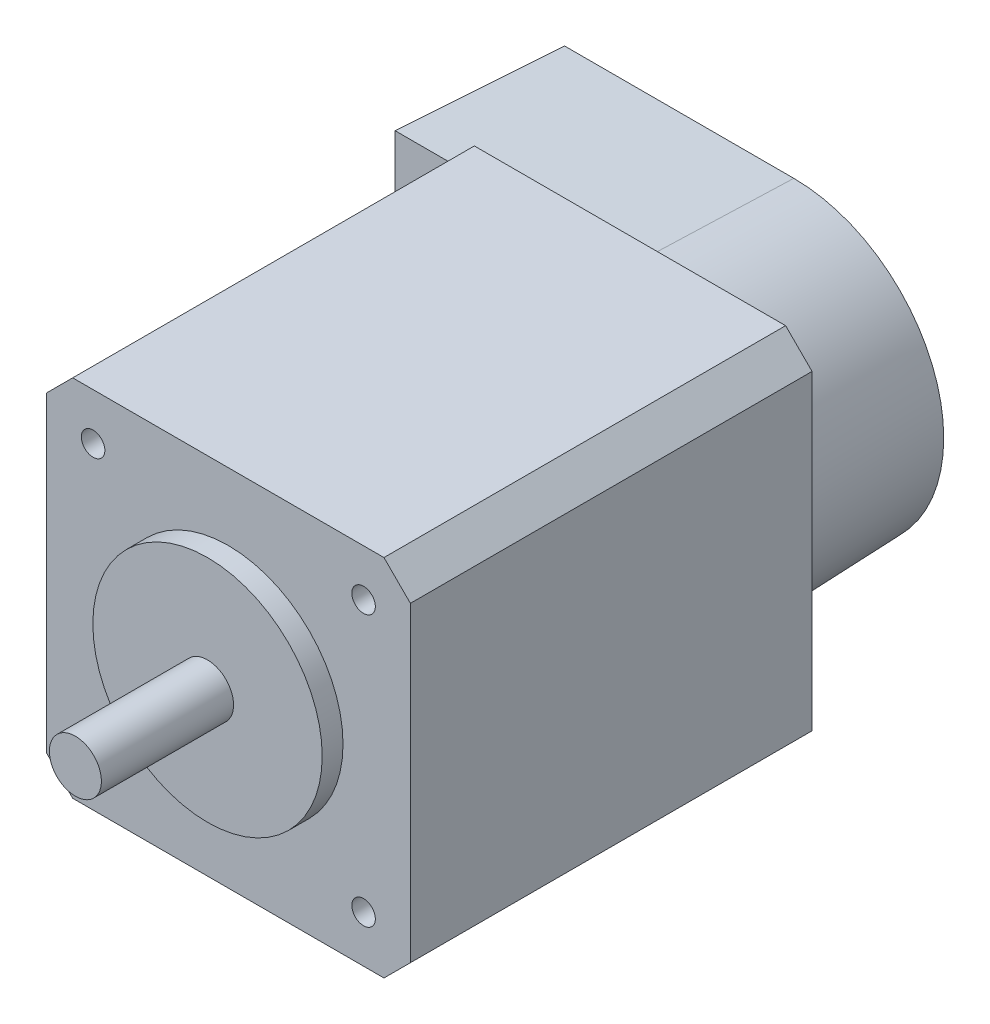
ISO-10303-21;
HEADER;
FILE_DESCRIPTION(('STEP AP214'),'2;1');
FILE_NAME('part.step','',(''),(''),'','','');
FILE_SCHEMA(('AUTOMOTIVE_DESIGN { 1 0 10303 214 1 1 1 1 }'));
ENDSEC;
DATA;
#1=APPLICATION_CONTEXT('core data for automotive mechanical design processes');
#2=APPLICATION_PROTOCOL_DEFINITION('international standard','automotive_design',2000,#1);
#3=PRODUCT_CONTEXT('',#1,'mechanical');
#4=PRODUCT('Part','Part','',(#3));
#5=PRODUCT_RELATED_PRODUCT_CATEGORY('part','',(#4));
#6=PRODUCT_DEFINITION_FORMATION('','',#4);
#7=PRODUCT_DEFINITION_CONTEXT('part definition',#1,'design');
#8=PRODUCT_DEFINITION('design','',#6,#7);
#9=PRODUCT_DEFINITION_SHAPE('','',#8);
#10=(LENGTH_UNIT() NAMED_UNIT(*) SI_UNIT(.MILLI.,.METRE.));
#11=(NAMED_UNIT(*) PLANE_ANGLE_UNIT() SI_UNIT($,.RADIAN.));
#12=(NAMED_UNIT(*) SI_UNIT($,.STERADIAN.) SOLID_ANGLE_UNIT());
#13=UNCERTAINTY_MEASURE_WITH_UNIT(LENGTH_MEASURE(1.E-05),#10,'distance_accuracy_value','');
#14=(GEOMETRIC_REPRESENTATION_CONTEXT(3) GLOBAL_UNCERTAINTY_ASSIGNED_CONTEXT((#13)) GLOBAL_UNIT_ASSIGNED_CONTEXT((#10,
#11,#12)) REPRESENTATION_CONTEXT('',''));
#15=CARTESIAN_POINT('',(0.,0.,0.));
#16=DIRECTION('',(0.,0.,1.));
#17=DIRECTION('',(1.,0.,0.));
#18=AXIS2_PLACEMENT_3D('',#15,#16,#17);
#19=CARTESIAN_POINT('',(0.,0.,38.608));
#20=DIRECTION('',(0.,0.,-1.));
#21=DIRECTION('',(-1.,0.,0.));
#22=AXIS2_PLACEMENT_3D('',#19,#20,#21);
#23=PLANE('',#22);
#24=CARTESIAN_POINT('',(4.49999999999995,30.5,38.608));
#25=DIRECTION('',(0.,0.,1.));
#26=DIRECTION('',(1.,0.,0.));
#27=AXIS2_PLACEMENT_3D('',#24,#25,#26);
#28=CIRCLE('',#27,1.1303);
#29=CARTESIAN_POINT('',(5.63029999999995,30.5,38.608));
#30=VERTEX_POINT('',#29);
#31=EDGE_CURVE('E148',#30,#30,#28,.T.);
#32=ORIENTED_EDGE('',*,*,#31,.F.);
#33=EDGE_LOOP('',(#32));
#34=FACE_BOUND('',#33,.T.);
#35=CARTESIAN_POINT('',(17.5,17.5,38.608));
#36=DIRECTION('',(0.,0.,-1.));
#37=DIRECTION('',(-1.,0.,0.));
#38=AXIS2_PLACEMENT_3D('',#35,#36,#37);
#39=CIRCLE('',#38,11.0236);
#40=CARTESIAN_POINT('',(6.47639999999998,17.5,38.608));
#41=VERTEX_POINT('',#40);
#42=EDGE_CURVE('E41',#41,#41,#39,.F.);
#43=ORIENTED_EDGE('',*,*,#42,.F.);
#44=EDGE_LOOP('',(#43));
#45=FACE_BOUND('',#44,.T.);
#46=DIRECTION('',(0.,-1.,0.));
#47=VECTOR('',#46,1.);
#48=CARTESIAN_POINT('',(0.,0.,38.608));
#49=LINE('',#48,#47);
#50=CARTESIAN_POINT('',(0.,32.46,38.608));
#51=VERTEX_POINT('',#50);
#52=CARTESIAN_POINT('',(0.,2.54000000000002,38.608));
#53=VERTEX_POINT('',#52);
#54=EDGE_CURVE('E205',#51,#53,#49,.T.);
#55=ORIENTED_EDGE('',*,*,#54,.T.);
#56=DIRECTION('',(-0.707106781186546,0.70710678118655,0.));
#57=VECTOR('',#56,1.);
#58=CARTESIAN_POINT('',(2.54,0.,38.608));
#59=LINE('',#58,#57);
#60=CARTESIAN_POINT('',(2.54,0.,38.608));
#61=VERTEX_POINT('',#60);
#62=EDGE_CURVE('E249',#53,#61,#59,.F.);
#63=ORIENTED_EDGE('',*,*,#62,.T.);
#64=DIRECTION('',(1.,0.,0.));
#65=VECTOR('',#64,1.);
#66=CARTESIAN_POINT('',(0.,0.,38.608));
#67=LINE('',#66,#65);
#68=CARTESIAN_POINT('',(32.46,0.,38.608));
#69=VERTEX_POINT('',#68);
#70=EDGE_CURVE('E208',#61,#69,#67,.T.);
#71=ORIENTED_EDGE('',*,*,#70,.T.);
#72=DIRECTION('',(-0.70710678118655,-0.707106781186546,0.));
#73=VECTOR('',#72,1.);
#74=CARTESIAN_POINT('',(35.,2.54,38.608));
#75=LINE('',#74,#73);
#76=CARTESIAN_POINT('',(35.,2.54,38.608));
#77=VERTEX_POINT('',#76);
#78=EDGE_CURVE('E247',#69,#77,#75,.F.);
#79=ORIENTED_EDGE('',*,*,#78,.T.);
#80=DIRECTION('',(0.,1.,0.));
#81=VECTOR('',#80,1.);
#82=CARTESIAN_POINT('',(35.,0.,38.608));
#83=LINE('',#82,#81);
#84=CARTESIAN_POINT('',(35.,32.46,38.608));
#85=VERTEX_POINT('',#84);
#86=EDGE_CURVE('E212',#77,#85,#83,.T.);
#87=ORIENTED_EDGE('',*,*,#86,.T.);
#88=DIRECTION('',(0.707106781186547,-0.707106781186549,0.));
#89=VECTOR('',#88,1.);
#90=CARTESIAN_POINT('',(32.46,35.,38.608));
#91=LINE('',#90,#89);
#92=CARTESIAN_POINT('',(32.46,35.,38.608));
#93=VERTEX_POINT('',#92);
#94=EDGE_CURVE('E243',#85,#93,#91,.F.);
#95=ORIENTED_EDGE('',*,*,#94,.T.);
#96=DIRECTION('',(-1.,0.,0.));
#97=VECTOR('',#96,1.);
#98=CARTESIAN_POINT('',(0.,35.,38.608));
#99=LINE('',#98,#97);
#100=CARTESIAN_POINT('',(2.54000000000002,35.,38.608));
#101=VERTEX_POINT('',#100);
#102=EDGE_CURVE('E215',#93,#101,#99,.T.);
#103=ORIENTED_EDGE('',*,*,#102,.T.);
#104=DIRECTION('',(0.707106781186549,0.707106781186547,0.));
#105=VECTOR('',#104,1.);
#106=CARTESIAN_POINT('',(0.,32.46,38.608));
#107=LINE('',#106,#105);
#108=EDGE_CURVE('E245',#101,#51,#107,.F.);
#109=ORIENTED_EDGE('',*,*,#108,.T.);
#110=EDGE_LOOP('',(#55,#63,#71,#79,#87,#95,#103,#109));
#111=FACE_BOUND('',#110,.T.);
#112=CARTESIAN_POINT('',(30.5,30.5,38.608));
#113=DIRECTION('',(0.,0.,1.));
#114=DIRECTION('',(1.,0.,0.));
#115=AXIS2_PLACEMENT_3D('',#112,#113,#114);
#116=CIRCLE('',#115,1.1303);
#117=CARTESIAN_POINT('',(31.6303,30.5,38.608));
#118=VERTEX_POINT('',#117);
#119=EDGE_CURVE('E190',#118,#118,#116,.T.);
#120=ORIENTED_EDGE('',*,*,#119,.F.);
#121=EDGE_LOOP('',(#120));
#122=FACE_BOUND('',#121,.T.);
#123=CARTESIAN_POINT('',(4.49999999999995,4.50000000000002,38.608));
#124=DIRECTION('',(0.,0.,1.));
#125=DIRECTION('',(1.,0.,0.));
#126=AXIS2_PLACEMENT_3D('',#123,#124,#125);
#127=CIRCLE('',#126,1.1303);
#128=CARTESIAN_POINT('',(5.63029999999995,4.50000000000002,38.608));
#129=VERTEX_POINT('',#128);
#130=EDGE_CURVE('E184',#129,#129,#127,.T.);
#131=ORIENTED_EDGE('',*,*,#130,.F.);
#132=EDGE_LOOP('',(#131));
#133=FACE_BOUND('',#132,.T.);
#134=CARTESIAN_POINT('',(30.5,4.50000000000002,38.608));
#135=DIRECTION('',(0.,0.,1.));
#136=DIRECTION('',(1.,0.,0.));
#137=AXIS2_PLACEMENT_3D('',#134,#135,#136);
#138=CIRCLE('',#137,1.1303);
#139=CARTESIAN_POINT('',(31.6303,4.50000000000002,38.608));
#140=VERTEX_POINT('',#139);
#141=EDGE_CURVE('E178',#140,#140,#138,.T.);
#142=ORIENTED_EDGE('',*,*,#141,.F.);
#143=EDGE_LOOP('',(#142));
#144=FACE_BOUND('',#143,.T.);
#145=ADVANCED_FACE('F37',(#34,#45,#111,#122,#133,#144),#23,.F.);
#146=CARTESIAN_POINT('',(17.5,17.5,40.608));
#147=DIRECTION('',(0.,0.,1.));
#148=DIRECTION('',(1.,0.,0.));
#149=AXIS2_PLACEMENT_3D('',#146,#147,#148);
#150=PLANE('',#149);
#151=CARTESIAN_POINT('',(17.5,17.5,40.608));
#152=DIRECTION('',(0.,0.,1.));
#153=DIRECTION('',(1.,0.,0.));
#154=AXIS2_PLACEMENT_3D('',#151,#152,#153);
#155=CIRCLE('',#154,11.0236);
#156=CARTESIAN_POINT('',(28.5236,17.5,40.608));
#157=VERTEX_POINT('',#156);
#158=EDGE_CURVE('E200',#157,#157,#155,.T.);
#159=ORIENTED_EDGE('',*,*,#158,.T.);
#160=EDGE_LOOP('',(#159));
#161=FACE_BOUND('',#160,.T.);
#162=CARTESIAN_POINT('',(17.5,17.5,40.608));
#163=DIRECTION('',(0.,0.,1.));
#164=DIRECTION('',(1.,0.,0.));
#165=AXIS2_PLACEMENT_3D('',#162,#163,#164);
#166=CIRCLE('',#165,2.5);
#167=CARTESIAN_POINT('',(20.,17.5,40.608));
#168=VERTEX_POINT('',#167);
#169=EDGE_CURVE('E196',#168,#168,#166,.T.);
#170=ORIENTED_EDGE('',*,*,#169,.F.);
#171=EDGE_LOOP('',(#170));
#172=FACE_BOUND('',#171,.T.);
#173=ADVANCED_FACE('F265',(#161,#172),#150,.T.);
#174=CARTESIAN_POINT('',(0.,0.,38.608));
#175=DIRECTION('',(1.,0.,0.));
#176=DIRECTION('',(0.,0.,-1.));
#177=AXIS2_PLACEMENT_3D('',#174,#175,#176);
#178=PLANE('',#177);
#179=DIRECTION('',(0.,-1.,0.));
#180=VECTOR('',#179,1.);
#181=CARTESIAN_POINT('',(0.,0.,0.));
#182=LINE('',#181,#180);
#183=CARTESIAN_POINT('',(0.,32.46,0.));
#184=VERTEX_POINT('',#183);
#185=CARTESIAN_POINT('',(0.,2.54000000000001,0.));
#186=VERTEX_POINT('',#185);
#187=EDGE_CURVE('E137',#184,#186,#182,.T.);
#188=ORIENTED_EDGE('',*,*,#187,.T.);
#189=DIRECTION('',(0.,0.,1.));
#190=VECTOR('',#189,1.);
#191=CARTESIAN_POINT('',(0.,2.54000000000001,38.608));
#192=LINE('',#191,#190);
#193=EDGE_CURVE('E241',#186,#53,#192,.T.);
#194=ORIENTED_EDGE('',*,*,#193,.T.);
#195=ORIENTED_EDGE('',*,*,#54,.F.);
#196=DIRECTION('',(0.,0.,-1.));
#197=VECTOR('',#196,1.);
#198=CARTESIAN_POINT('',(0.,32.46,38.608));
#199=LINE('',#198,#197);
#200=EDGE_CURVE('E238',#51,#184,#199,.T.);
#201=ORIENTED_EDGE('',*,*,#200,.T.);
#202=EDGE_LOOP('',(#188,#194,#195,#201));
#203=FACE_BOUND('',#202,.T.);
#204=ADVANCED_FACE('F309',(#203),#178,.F.);
#205=CARTESIAN_POINT('',(0.,0.,38.608));
#206=DIRECTION('',(0.,1.,0.));
#207=DIRECTION('',(0.,0.,1.));
#208=AXIS2_PLACEMENT_3D('',#205,#206,#207);
#209=PLANE('',#208);
#210=ORIENTED_EDGE('',*,*,#70,.F.);
#211=DIRECTION('',(0.,0.,-1.));
#212=VECTOR('',#211,1.);
#213=CARTESIAN_POINT('',(2.54,0.,38.608));
#214=LINE('',#213,#212);
#215=CARTESIAN_POINT('',(2.54,0.,0.));
#216=VERTEX_POINT('',#215);
#217=EDGE_CURVE('E227',#61,#216,#214,.T.);
#218=ORIENTED_EDGE('',*,*,#217,.T.);
#219=DIRECTION('',(1.,0.,0.));
#220=VECTOR('',#219,1.);
#221=CARTESIAN_POINT('',(0.,0.,0.));
#222=LINE('',#221,#220);
#223=CARTESIAN_POINT('',(32.46,0.,0.));
#224=VERTEX_POINT('',#223);
#225=EDGE_CURVE('E219',#216,#224,#222,.T.);
#226=ORIENTED_EDGE('',*,*,#225,.T.);
#227=DIRECTION('',(0.,0.,1.));
#228=VECTOR('',#227,1.);
#229=CARTESIAN_POINT('',(32.46,0.,38.608));
#230=LINE('',#229,#228);
#231=EDGE_CURVE('E217',#224,#69,#230,.T.);
#232=ORIENTED_EDGE('',*,*,#231,.T.);
#233=EDGE_LOOP('',(#210,#218,#226,#232));
#234=FACE_BOUND('',#233,.T.);
#235=ADVANCED_FACE('F324',(#234),#209,.F.);
#236=CARTESIAN_POINT('',(35.,0.,38.608));
#237=DIRECTION('',(-1.,0.,0.));
#238=DIRECTION('',(0.,0.,1.));
#239=AXIS2_PLACEMENT_3D('',#236,#237,#238);
#240=PLANE('',#239);
#241=ORIENTED_EDGE('',*,*,#86,.F.);
#242=DIRECTION('',(0.,0.,-1.));
#243=VECTOR('',#242,1.);
#244=CARTESIAN_POINT('',(35.,2.54,38.608));
#245=LINE('',#244,#243);
#246=CARTESIAN_POINT('',(35.,2.54,0.));
#247=VERTEX_POINT('',#246);
#248=EDGE_CURVE('E253',#77,#247,#245,.T.);
#249=ORIENTED_EDGE('',*,*,#248,.T.);
#250=DIRECTION('',(0.,1.,0.));
#251=VECTOR('',#250,1.);
#252=CARTESIAN_POINT('',(35.,0.,0.));
#253=LINE('',#252,#251);
#254=CARTESIAN_POINT('',(35.,32.46,0.));
#255=VERTEX_POINT('',#254);
#256=EDGE_CURVE('E222',#247,#255,#253,.T.);
#257=ORIENTED_EDGE('',*,*,#256,.T.);
#258=DIRECTION('',(0.,0.,1.));
#259=VECTOR('',#258,1.);
#260=CARTESIAN_POINT('',(35.,32.46,38.608));
#261=LINE('',#260,#259);
#262=EDGE_CURVE('E251',#255,#85,#261,.T.);
#263=ORIENTED_EDGE('',*,*,#262,.T.);
#264=EDGE_LOOP('',(#241,#249,#257,#263));
#265=FACE_BOUND('',#264,.T.);
#266=ADVANCED_FACE('F321',(#265),#240,.F.);
#267=CARTESIAN_POINT('',(0.,35.,38.608));
#268=DIRECTION('',(0.,-1.,0.));
#269=DIRECTION('',(0.,0.,-1.));
#270=AXIS2_PLACEMENT_3D('',#267,#268,#269);
#271=PLANE('',#270);
#272=DIRECTION('',(-1.,0.,0.));
#273=VECTOR('',#272,1.);
#274=CARTESIAN_POINT('',(0.,35.,0.));
#275=LINE('',#274,#273);
#276=CARTESIAN_POINT('',(32.46,35.,0.));
#277=VERTEX_POINT('',#276);
#278=CARTESIAN_POINT('',(2.54000000000001,35.,0.));
#279=VERTEX_POINT('',#278);
#280=EDGE_CURVE('E209',#277,#279,#275,.T.);
#281=ORIENTED_EDGE('',*,*,#280,.T.);
#282=DIRECTION('',(0.,0.,1.));
#283=VECTOR('',#282,1.);
#284=CARTESIAN_POINT('',(2.54000000000001,35.,38.608));
#285=LINE('',#284,#283);
#286=EDGE_CURVE('E62',#279,#101,#285,.T.);
#287=ORIENTED_EDGE('',*,*,#286,.T.);
#288=ORIENTED_EDGE('',*,*,#102,.F.);
#289=DIRECTION('',(0.,0.,-1.));
#290=VECTOR('',#289,1.);
#291=CARTESIAN_POINT('',(32.46,35.,38.608));
#292=LINE('',#291,#290);
#293=EDGE_CURVE('E256',#93,#277,#292,.T.);
#294=ORIENTED_EDGE('',*,*,#293,.T.);
#295=EDGE_LOOP('',(#281,#287,#288,#294));
#296=FACE_BOUND('',#295,.T.);
#297=ADVANCED_FACE('F318',(#296),#271,.F.);
#298=CARTESIAN_POINT('',(0.,0.,0.));
#299=DIRECTION('',(0.,0.,-1.));
#300=DIRECTION('',(-1.,0.,0.));
#301=AXIS2_PLACEMENT_3D('',#298,#299,#300);
#302=PLANE('',#301);
#303=DIRECTION('',(-1.,0.,0.));
#304=VECTOR('',#303,1.);
#305=CARTESIAN_POINT('',(-5.08000000000001,2.54,0.));
#306=LINE('',#305,#304);
#307=CARTESIAN_POINT('',(17.5,2.54,0.));
#308=VERTEX_POINT('',#307);
#309=EDGE_CURVE('E54',#308,#186,#306,.T.);
#310=ORIENTED_EDGE('',*,*,#309,.F.);
#311=CARTESIAN_POINT('',(17.5,17.5,0.));
#312=DIRECTION('',(0.,0.,-1.));
#313=DIRECTION('',(1.,0.,0.));
#314=AXIS2_PLACEMENT_3D('',#311,#312,#313);
#315=CIRCLE('',#314,14.96);
#316=CARTESIAN_POINT('',(17.5,32.46,0.));
#317=VERTEX_POINT('',#316);
#318=EDGE_CURVE('E139',#317,#308,#315,.T.);
#319=ORIENTED_EDGE('',*,*,#318,.F.);
#320=DIRECTION('',(1.,0.,0.));
#321=VECTOR('',#320,1.);
#322=CARTESIAN_POINT('',(17.5,32.46,0.));
#323=LINE('',#322,#321);
#324=EDGE_CURVE('E11',#184,#317,#323,.T.);
#325=ORIENTED_EDGE('',*,*,#324,.F.);
#326=DIRECTION('',(-0.707106781186549,-0.707106781186547,0.));
#327=VECTOR('',#326,1.);
#328=CARTESIAN_POINT('',(-16.23,16.23,0.));
#329=LINE('',#328,#327);
#330=EDGE_CURVE('E232',#184,#279,#329,.F.);
#331=ORIENTED_EDGE('',*,*,#330,.T.);
#332=ORIENTED_EDGE('',*,*,#280,.F.);
#333=DIRECTION('',(-0.707106781186547,0.707106781186549,0.));
#334=VECTOR('',#333,1.);
#335=CARTESIAN_POINT('',(33.7300000000001,33.73,0.));
#336=LINE('',#335,#334);
#337=EDGE_CURVE('E230',#277,#255,#336,.F.);
#338=ORIENTED_EDGE('',*,*,#337,.T.);
#339=ORIENTED_EDGE('',*,*,#256,.F.);
#340=DIRECTION('',(0.70710678118655,0.707106781186546,0.));
#341=VECTOR('',#340,1.);
#342=CARTESIAN_POINT('',(16.2299999999999,-16.23,0.));
#343=LINE('',#342,#341);
#344=EDGE_CURVE('E234',#247,#224,#343,.F.);
#345=ORIENTED_EDGE('',*,*,#344,.T.);
#346=ORIENTED_EDGE('',*,*,#225,.F.);
#347=DIRECTION('',(0.707106781186546,-0.70710678118655,0.));
#348=VECTOR('',#347,1.);
#349=CARTESIAN_POINT('',(1.27000000000001,1.27,0.));
#350=LINE('',#349,#348);
#351=EDGE_CURVE('E236',#216,#186,#350,.F.);
#352=ORIENTED_EDGE('',*,*,#351,.T.);
#353=EDGE_LOOP('',(#310,#319,#325,#331,#332,#338,#339,#345,#346,#352));
#354=FACE_BOUND('',#353,.T.);
#355=CARTESIAN_POINT('',(30.5,4.50000000000002,0.));
#356=DIRECTION('',(0.,0.,1.));
#357=DIRECTION('',(1.,0.,0.));
#358=AXIS2_PLACEMENT_3D('',#355,#356,#357);
#359=CIRCLE('',#358,1.13029999999999);
#360=CARTESIAN_POINT('',(31.6303,4.50000000000002,0.));
#361=VERTEX_POINT('',#360);
#362=EDGE_CURVE('E181',#361,#361,#359,.T.);
#363=ORIENTED_EDGE('',*,*,#362,.T.);
#364=EDGE_LOOP('',(#363));
#365=FACE_BOUND('',#364,.T.);
#366=CARTESIAN_POINT('',(30.5,30.5,0.));
#367=DIRECTION('',(0.,0.,1.));
#368=DIRECTION('',(1.,0.,0.));
#369=AXIS2_PLACEMENT_3D('',#366,#367,#368);
#370=CIRCLE('',#369,1.13029999999999);
#371=CARTESIAN_POINT('',(31.6303,30.5,0.));
#372=VERTEX_POINT('',#371);
#373=EDGE_CURVE('E193',#372,#372,#370,.T.);
#374=ORIENTED_EDGE('',*,*,#373,.T.);
#375=EDGE_LOOP('',(#374));
#376=FACE_BOUND('',#375,.T.);
#377=ADVANCED_FACE('F314',(#354,#365,#376),#302,.T.);
#378=CARTESIAN_POINT('',(2.54,0.,38.608));
#379=DIRECTION('',(0.70710678118655,0.707106781186546,0.));
#380=DIRECTION('',(0.,0.,-1.));
#381=AXIS2_PLACEMENT_3D('',#378,#379,#380);
#382=PLANE('',#381);
#383=ORIENTED_EDGE('',*,*,#62,.F.);
#384=ORIENTED_EDGE('',*,*,#193,.F.);
#385=ORIENTED_EDGE('',*,*,#351,.F.);
#386=ORIENTED_EDGE('',*,*,#217,.F.);
#387=EDGE_LOOP('',(#383,#384,#385,#386));
#388=FACE_BOUND('',#387,.T.);
#389=ADVANCED_FACE('F317',(#388),#382,.F.);
#390=CARTESIAN_POINT('',(35.,2.54,38.608));
#391=DIRECTION('',(-0.707106781186546,0.70710678118655,0.));
#392=DIRECTION('',(0.,0.,-1.));
#393=AXIS2_PLACEMENT_3D('',#390,#391,#392);
#394=PLANE('',#393);
#395=ORIENTED_EDGE('',*,*,#78,.F.);
#396=ORIENTED_EDGE('',*,*,#231,.F.);
#397=ORIENTED_EDGE('',*,*,#344,.F.);
#398=ORIENTED_EDGE('',*,*,#248,.F.);
#399=EDGE_LOOP('',(#395,#396,#397,#398));
#400=FACE_BOUND('',#399,.T.);
#401=ADVANCED_FACE('F334',(#400),#394,.F.);
#402=CARTESIAN_POINT('',(0.,32.46,38.608));
#403=DIRECTION('',(0.707106781186547,-0.707106781186549,0.));
#404=DIRECTION('',(0.,0.,-1.));
#405=AXIS2_PLACEMENT_3D('',#402,#403,#404);
#406=PLANE('',#405);
#407=ORIENTED_EDGE('',*,*,#108,.F.);
#408=ORIENTED_EDGE('',*,*,#286,.F.);
#409=ORIENTED_EDGE('',*,*,#330,.F.);
#410=ORIENTED_EDGE('',*,*,#200,.F.);
#411=EDGE_LOOP('',(#407,#408,#409,#410));
#412=FACE_BOUND('',#411,.T.);
#413=ADVANCED_FACE('F337',(#412),#406,.F.);
#414=CARTESIAN_POINT('',(32.46,35.,38.608));
#415=DIRECTION('',(-0.707106781186549,-0.707106781186547,0.));
#416=DIRECTION('',(0.,0.,-1.));
#417=AXIS2_PLACEMENT_3D('',#414,#415,#416);
#418=PLANE('',#417);
#419=ORIENTED_EDGE('',*,*,#94,.F.);
#420=ORIENTED_EDGE('',*,*,#262,.F.);
#421=ORIENTED_EDGE('',*,*,#337,.F.);
#422=ORIENTED_EDGE('',*,*,#293,.F.);
#423=EDGE_LOOP('',(#419,#420,#421,#422));
#424=FACE_BOUND('',#423,.T.);
#425=ADVANCED_FACE('F39',(#424),#418,.F.);
#426=CARTESIAN_POINT('',(17.5,17.5,40.608));
#427=DIRECTION('',(0.,0.,-1.));
#428=DIRECTION('',(-1.,0.,0.));
#429=AXIS2_PLACEMENT_3D('',#426,#427,#428);
#430=CYLINDRICAL_SURFACE('',#429,11.0236);
#431=ORIENTED_EDGE('',*,*,#158,.F.);
#432=EDGE_LOOP('',(#431));
#433=FACE_BOUND('',#432,.T.);
#434=ORIENTED_EDGE('',*,*,#42,.T.);
#435=EDGE_LOOP('',(#434));
#436=FACE_BOUND('',#435,.T.);
#437=ADVANCED_FACE('F261',(#433,#436),#430,.T.);
#438=CARTESIAN_POINT('',(17.5,17.5,53.308));
#439=DIRECTION('',(0.,0.,-1.));
#440=DIRECTION('',(-1.,0.,0.));
#441=AXIS2_PLACEMENT_3D('',#438,#439,#440);
#442=CYLINDRICAL_SURFACE('',#441,2.5);
#443=CARTESIAN_POINT('',(17.5,17.5,53.308));
#444=DIRECTION('',(0.,0.,1.));
#445=DIRECTION('',(1.,0.,0.));
#446=AXIS2_PLACEMENT_3D('',#443,#444,#445);
#447=CIRCLE('',#446,2.5);
#448=CARTESIAN_POINT('',(20.,17.5,53.308));
#449=VERTEX_POINT('',#448);
#450=EDGE_CURVE('E197',#449,#449,#447,.T.);
#451=ORIENTED_EDGE('',*,*,#450,.F.);
#452=EDGE_LOOP('',(#451));
#453=FACE_BOUND('',#452,.T.);
#454=ORIENTED_EDGE('',*,*,#169,.T.);
#455=EDGE_LOOP('',(#454));
#456=FACE_BOUND('',#455,.T.);
#457=ADVANCED_FACE('F302',(#453,#456),#442,.T.);
#458=CARTESIAN_POINT('',(17.5,17.5,53.308));
#459=DIRECTION('',(0.,0.,1.));
#460=DIRECTION('',(1.,0.,0.));
#461=AXIS2_PLACEMENT_3D('',#458,#459,#460);
#462=PLANE('',#461);
#463=ORIENTED_EDGE('',*,*,#450,.T.);
#464=EDGE_LOOP('',(#463));
#465=FACE_BOUND('',#464,.T.);
#466=ADVANCED_FACE('F298',(#465),#462,.T.);
#467=CARTESIAN_POINT('',(30.5,30.5,38.608));
#468=DIRECTION('',(0.,0.,1.));
#469=DIRECTION('',(1.,0.,0.));
#470=AXIS2_PLACEMENT_3D('',#467,#468,#469);
#471=CYLINDRICAL_SURFACE('',#470,1.1303);
#472=ORIENTED_EDGE('',*,*,#373,.F.);
#473=EDGE_LOOP('',(#472));
#474=FACE_BOUND('',#473,.T.);
#475=ORIENTED_EDGE('',*,*,#119,.T.);
#476=EDGE_LOOP('',(#475));
#477=FACE_BOUND('',#476,.T.);
#478=ADVANCED_FACE('F290',(#474,#477),#471,.F.);
#479=CARTESIAN_POINT('',(4.49999999999995,4.50000000000002,38.608));
#480=DIRECTION('',(0.,0.,1.));
#481=DIRECTION('',(1.,0.,0.));
#482=AXIS2_PLACEMENT_3D('',#479,#480,#481);
#483=CYLINDRICAL_SURFACE('',#482,1.1303);
#484=CARTESIAN_POINT('',(4.49999999999995,4.50000000000002,0.));
#485=DIRECTION('',(0.,0.,1.));
#486=DIRECTION('',(1.,0.,0.));
#487=AXIS2_PLACEMENT_3D('',#484,#485,#486);
#488=CIRCLE('',#487,1.13029999999999);
#489=CARTESIAN_POINT('',(5.63029999999995,4.50000000000002,0.));
#490=VERTEX_POINT('',#489);
#491=EDGE_CURVE('E187',#490,#490,#488,.T.);
#492=ORIENTED_EDGE('',*,*,#491,.F.);
#493=EDGE_LOOP('',(#492));
#494=FACE_BOUND('',#493,.T.);
#495=ORIENTED_EDGE('',*,*,#130,.T.);
#496=EDGE_LOOP('',(#495));
#497=FACE_BOUND('',#496,.T.);
#498=ADVANCED_FACE('F280',(#494,#497),#483,.F.);
#499=CARTESIAN_POINT('',(30.5,4.50000000000002,38.608));
#500=DIRECTION('',(0.,0.,1.));
#501=DIRECTION('',(1.,0.,0.));
#502=AXIS2_PLACEMENT_3D('',#499,#500,#501);
#503=CYLINDRICAL_SURFACE('',#502,1.1303);
#504=ORIENTED_EDGE('',*,*,#362,.F.);
#505=EDGE_LOOP('',(#504));
#506=FACE_BOUND('',#505,.T.);
#507=ORIENTED_EDGE('',*,*,#141,.T.);
#508=EDGE_LOOP('',(#507));
#509=FACE_BOUND('',#508,.T.);
#510=ADVANCED_FACE('F277',(#506,#509),#503,.F.);
#511=CARTESIAN_POINT('',(4.49999999999995,30.5,38.608));
#512=DIRECTION('',(0.,0.,1.));
#513=DIRECTION('',(1.,0.,0.));
#514=AXIS2_PLACEMENT_3D('',#511,#512,#513);
#515=CYLINDRICAL_SURFACE('',#514,1.1303);
#516=CARTESIAN_POINT('',(4.49999999999995,30.5,0.));
#517=DIRECTION('',(0.,0.,1.));
#518=DIRECTION('',(1.,0.,0.));
#519=AXIS2_PLACEMENT_3D('',#516,#517,#518);
#520=CIRCLE('',#519,1.13029999999999);
#521=CARTESIAN_POINT('',(5.63029999999994,30.5,0.));
#522=VERTEX_POINT('',#521);
#523=EDGE_CURVE('E175',#522,#522,#520,.T.);
#524=ORIENTED_EDGE('',*,*,#523,.F.);
#525=EDGE_LOOP('',(#524));
#526=FACE_BOUND('',#525,.T.);
#527=ORIENTED_EDGE('',*,*,#31,.T.);
#528=EDGE_LOOP('',(#527));
#529=FACE_BOUND('',#528,.T.);
#530=ADVANCED_FACE('F279',(#526,#529),#515,.F.);
#531=CARTESIAN_POINT('',(17.5,17.5,-15.748));
#532=DIRECTION('',(0.,0.,1.));
#533=DIRECTION('',(1.,0.,0.));
#534=AXIS2_PLACEMENT_3D('',#531,#532,#533);
#535=PLANE('',#534);
#536=DIRECTION('',(0.,-1.,0.));
#537=VECTOR('',#536,1.);
#538=CARTESIAN_POINT('',(-4.53006772204395,17.5,-15.748));
#539=LINE('',#538,#537);
#540=CARTESIAN_POINT('',(-4.53006772204396,3.08993227795604,-15.748));
#541=VERTEX_POINT('',#540);
#542=CARTESIAN_POINT('',(-4.53006772204396,31.910067722044,-15.748));
#543=VERTEX_POINT('',#542);
#544=EDGE_CURVE('E159',#541,#543,#539,.F.);
#545=ORIENTED_EDGE('',*,*,#544,.T.);
#546=DIRECTION('',(-1.,0.,0.));
#547=VECTOR('',#546,1.);
#548=CARTESIAN_POINT('',(17.5,31.910067722044,-15.748));
#549=LINE('',#548,#547);
#550=CARTESIAN_POINT('',(17.5,31.910067722044,-15.748));
#551=VERTEX_POINT('',#550);
#552=EDGE_CURVE('E144',#543,#551,#549,.F.);
#553=ORIENTED_EDGE('',*,*,#552,.T.);
#554=CARTESIAN_POINT('',(17.5,17.5,-15.748));
#555=DIRECTION('',(0.,0.,1.));
#556=DIRECTION('',(1.,0.,0.));
#557=AXIS2_PLACEMENT_3D('',#554,#555,#556);
#558=CIRCLE('',#557,14.410067722044);
#559=CARTESIAN_POINT('',(17.5,3.08993227795604,-15.748));
#560=VERTEX_POINT('',#559);
#561=EDGE_CURVE('E170',#551,#560,#558,.F.);
#562=ORIENTED_EDGE('',*,*,#561,.T.);
#563=DIRECTION('',(1.,0.,0.));
#564=VECTOR('',#563,1.);
#565=CARTESIAN_POINT('',(17.5,3.08993227795604,-15.748));
#566=LINE('',#565,#564);
#567=EDGE_CURVE('E163',#560,#541,#566,.F.);
#568=ORIENTED_EDGE('',*,*,#567,.T.);
#569=EDGE_LOOP('',(#545,#553,#562,#568));
#570=FACE_BOUND('',#569,.T.);
#571=ADVANCED_FACE('F287',(#570),#535,.F.);
#572=CARTESIAN_POINT('',(-5.08000000000001,2.54,0.));
#573=DIRECTION('',(0.,-0.999390827019096,-0.034899496702501));
#574=DIRECTION('',(0.,0.034899496702501,-0.999390827019096));
#575=AXIS2_PLACEMENT_3D('',#572,#573,#574);
#576=PLANE('',#575);
#577=ORIENTED_EDGE('',*,*,#309,.T.);
#578=CARTESIAN_POINT('',(-5.08000000000001,2.54,0.));
#579=VERTEX_POINT('',#578);
#580=EDGE_CURVE('E158',#186,#579,#306,.T.);
#581=ORIENTED_EDGE('',*,*,#580,.T.);
#582=DIRECTION('',(-0.0348782627423747,-0.0348782627423747,0.998782765958718));
#583=VECTOR('',#582,1.);
#584=CARTESIAN_POINT('',(-5.04360252309918,2.57639747690083,-1.04228736739122));
#585=LINE('',#584,#583);
#586=EDGE_CURVE('E154',#541,#579,#585,.T.);
#587=ORIENTED_EDGE('',*,*,#586,.F.);
#588=ORIENTED_EDGE('',*,*,#567,.F.);
#589=DIRECTION('',(0.,-0.034899496702501,0.999390827019096));
#590=VECTOR('',#589,1.);
#591=CARTESIAN_POINT('',(17.5,2.54,0.));
#592=LINE('',#591,#590);
#593=EDGE_CURVE('E162',#560,#308,#592,.T.);
#594=ORIENTED_EDGE('',*,*,#593,.T.);
#595=EDGE_LOOP('',(#577,#581,#587,#588,#594));
#596=FACE_BOUND('',#595,.T.);
#597=ADVANCED_FACE('F351',(#596),#576,.T.);
#598=CARTESIAN_POINT('',(17.5,17.5,0.));
#599=DIRECTION('',(0.,0.,1.));
#600=DIRECTION('',(1.,0.,0.));
#601=AXIS2_PLACEMENT_3D('',#598,#599,#600);
#602=CONICAL_SURFACE('',#601,14.96,0.0349065850398867);
#603=ORIENTED_EDGE('',*,*,#318,.T.);
#604=ORIENTED_EDGE('',*,*,#593,.F.);
#605=ORIENTED_EDGE('',*,*,#561,.F.);
#606=DIRECTION('',(0.,0.034899496702501,0.999390827019096));
#607=VECTOR('',#606,1.);
#608=CARTESIAN_POINT('',(17.5,32.46,0.));
#609=LINE('',#608,#607);
#610=EDGE_CURVE('E149',#551,#317,#609,.T.);
#611=ORIENTED_EDGE('',*,*,#610,.T.);
#612=EDGE_LOOP('',(#603,#604,#605,#611));
#613=FACE_BOUND('',#612,.T.);
#614=ADVANCED_FACE('F356',(#613),#602,.T.);
#615=CARTESIAN_POINT('',(17.5,32.46,0.));
#616=DIRECTION('',(0.,0.999390827019096,-0.034899496702501));
#617=DIRECTION('',(0.,0.034899496702501,0.999390827019096));
#618=AXIS2_PLACEMENT_3D('',#615,#616,#617);
#619=PLANE('',#618);
#620=CARTESIAN_POINT('',(-5.08,32.46,0.));
#621=VERTEX_POINT('',#620);
#622=EDGE_CURVE('E47',#621,#184,#323,.T.);
#623=ORIENTED_EDGE('',*,*,#622,.T.);
#624=ORIENTED_EDGE('',*,*,#324,.T.);
#625=ORIENTED_EDGE('',*,*,#610,.F.);
#626=ORIENTED_EDGE('',*,*,#552,.F.);
#627=DIRECTION('',(-0.0348782627423747,0.0348782627423747,0.998782765958718));
#628=VECTOR('',#627,1.);
#629=CARTESIAN_POINT('',(-5.05253158327471,32.4325315832747,-0.786592538626131));
#630=LINE('',#629,#628);
#631=EDGE_CURVE('E141',#543,#621,#630,.T.);
#632=ORIENTED_EDGE('',*,*,#631,.T.);
#633=EDGE_LOOP('',(#623,#624,#625,#626,#632));
#634=FACE_BOUND('',#633,.T.);
#635=ADVANCED_FACE('F142',(#634),#619,.T.);
#636=CARTESIAN_POINT('',(-5.08,32.46,0.));
#637=DIRECTION('',(-0.999390827019096,0.,-0.034899496702501));
#638=DIRECTION('',(-0.034899496702501,0.,0.999390827019096));
#639=AXIS2_PLACEMENT_3D('',#636,#637,#638);
#640=PLANE('',#639);
#641=DIRECTION('',(0.,1.,0.));
#642=VECTOR('',#641,1.);
#643=CARTESIAN_POINT('',(-5.08,32.46,0.));
#644=LINE('',#643,#642);
#645=EDGE_CURVE('E135',#579,#621,#644,.T.);
#646=ORIENTED_EDGE('',*,*,#645,.T.);
#647=ORIENTED_EDGE('',*,*,#631,.F.);
#648=ORIENTED_EDGE('',*,*,#544,.F.);
#649=ORIENTED_EDGE('',*,*,#586,.T.);
#650=EDGE_LOOP('',(#646,#647,#648,#649));
#651=FACE_BOUND('',#650,.T.);
#652=ADVANCED_FACE('F152',(#651),#640,.T.);
#653=CARTESIAN_POINT('',(17.5,17.5,0.));
#654=DIRECTION('',(0.,0.,1.));
#655=DIRECTION('',(1.,0.,0.));
#656=AXIS2_PLACEMENT_3D('',#653,#654,#655);
#657=PLANE('',#656);
#658=ORIENTED_EDGE('',*,*,#187,.F.);
#659=ORIENTED_EDGE('',*,*,#622,.F.);
#660=ORIENTED_EDGE('',*,*,#645,.F.);
#661=ORIENTED_EDGE('',*,*,#580,.F.);
#662=EDGE_LOOP('',(#658,#659,#660,#661));
#663=FACE_BOUND('',#662,.T.);
#664=ADVANCED_FACE('F132',(#663),#657,.T.);
#665=ORIENTED_EDGE('',*,*,#491,.T.);
#666=EDGE_LOOP('',(#665));
#667=FACE_BOUND('',#666,.T.);
#668=ADVANCED_FACE('F380',(#667),#657,.T.);
#669=ORIENTED_EDGE('',*,*,#523,.T.);
#670=EDGE_LOOP('',(#669));
#671=FACE_BOUND('',#670,.T.);
#672=ADVANCED_FACE('F383',(#671),#657,.T.);
#673=CLOSED_SHELL('',(#145,#173,#204,#235,#266,#297,#377,#389,#401,#413,#425,#437,#457,#466,
#478,#498,#510,#530,#571,#597,#614,#635,#652,#664,#668,#672));
#674=MANIFOLD_SOLID_BREP('B2',#673);
#675=ADVANCED_BREP_SHAPE_REPRESENTATION('',(#18,#674),#14);
#676=SHAPE_DEFINITION_REPRESENTATION(#9,#675);
ENDSEC;
END-ISO-10303-21;
